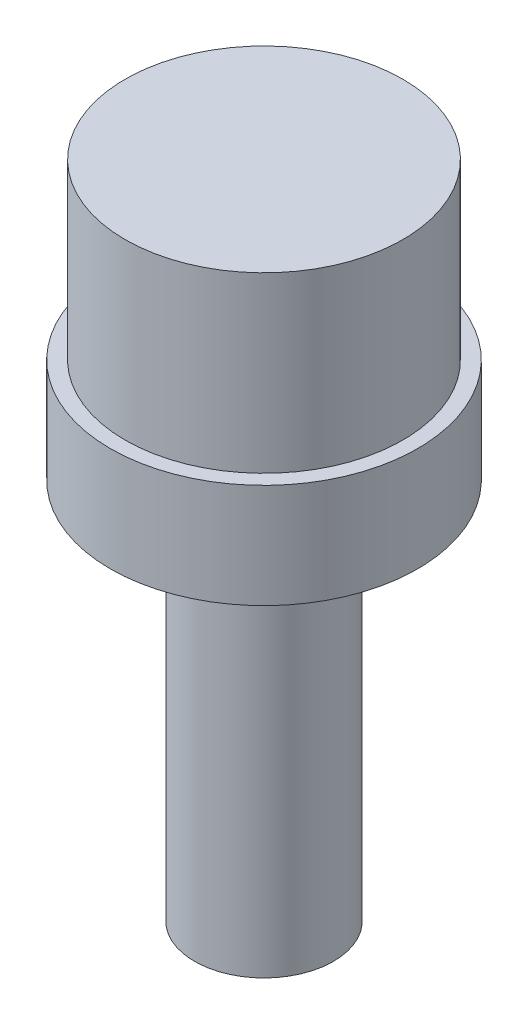
ISO-10303-21;
HEADER;
FILE_DESCRIPTION(('STEP AP214'),'2;1');
FILE_NAME('part.step','',(''),(''),'','','');
FILE_SCHEMA(('AUTOMOTIVE_DESIGN { 1 0 10303 214 1 1 1 1 }'));
ENDSEC;
DATA;
#1=APPLICATION_CONTEXT('core data for automotive mechanical design processes');
#2=APPLICATION_PROTOCOL_DEFINITION('international standard','automotive_design',2000,#1);
#3=PRODUCT_CONTEXT('',#1,'mechanical');
#4=PRODUCT('Part','Part','',(#3));
#5=PRODUCT_RELATED_PRODUCT_CATEGORY('part','',(#4));
#6=PRODUCT_DEFINITION_FORMATION('','',#4);
#7=PRODUCT_DEFINITION_CONTEXT('part definition',#1,'design');
#8=PRODUCT_DEFINITION('design','',#6,#7);
#9=PRODUCT_DEFINITION_SHAPE('','',#8);
#10=(LENGTH_UNIT() NAMED_UNIT(*) SI_UNIT(.MILLI.,.METRE.));
#11=(NAMED_UNIT(*) PLANE_ANGLE_UNIT() SI_UNIT($,.RADIAN.));
#12=(NAMED_UNIT(*) SI_UNIT($,.STERADIAN.) SOLID_ANGLE_UNIT());
#13=UNCERTAINTY_MEASURE_WITH_UNIT(LENGTH_MEASURE(1.E-05),#10,'distance_accuracy_value','');
#14=(GEOMETRIC_REPRESENTATION_CONTEXT(3) GLOBAL_UNCERTAINTY_ASSIGNED_CONTEXT((#13)) GLOBAL_UNIT_ASSIGNED_CONTEXT((#10,
#11,#12)) REPRESENTATION_CONTEXT('',''));
#15=CARTESIAN_POINT('',(0.,0.,0.));
#16=DIRECTION('',(0.,0.,1.));
#17=DIRECTION('',(1.,0.,0.));
#18=AXIS2_PLACEMENT_3D('',#15,#16,#17);
#19=CARTESIAN_POINT('',(0.,0.,0.));
#20=DIRECTION('',(0.,1.,0.));
#21=DIRECTION('',(0.,0.,1.));
#22=AXIS2_PLACEMENT_3D('',#19,#20,#21);
#23=PLANE('',#22);
#24=CARTESIAN_POINT('',(0.,0.,0.));
#25=DIRECTION('',(0.,1.,0.));
#26=DIRECTION('',(0.,0.,1.));
#27=AXIS2_PLACEMENT_3D('',#24,#25,#26);
#28=CIRCLE('',#27,4.425);
#29=CARTESIAN_POINT('',(0.,0.,4.425));
#30=VERTEX_POINT('',#29);
#31=EDGE_CURVE('E51',#30,#30,#28,.T.);
#32=ORIENTED_EDGE('',*,*,#31,.F.);
#33=EDGE_LOOP('',(#32));
#34=FACE_BOUND('',#33,.T.);
#35=DIRECTION('',(1.,0.,0.));
#36=VECTOR('',#35,1.);
#37=CARTESIAN_POINT('',(0.,0.,-1.5));
#38=LINE('',#37,#36);
#39=CARTESIAN_POINT('',(-1.3228756555323,0.,-1.5));
#40=VERTEX_POINT('',#39);
#41=CARTESIAN_POINT('',(1.3228756555323,0.,-1.5));
#42=VERTEX_POINT('',#41);
#43=EDGE_CURVE('E63',#40,#42,#38,.T.);
#44=ORIENTED_EDGE('',*,*,#43,.F.);
#45=CARTESIAN_POINT('',(0.,0.,0.));
#46=DIRECTION('',(0.,1.,0.));
#47=DIRECTION('',(0.,0.,1.));
#48=AXIS2_PLACEMENT_3D('',#45,#46,#47);
#49=CIRCLE('',#48,2.);
#50=EDGE_CURVE('E85',#40,#42,#49,.T.);
#51=ORIENTED_EDGE('',*,*,#50,.T.);
#52=EDGE_LOOP('',(#44,#51));
#53=FACE_BOUND('',#52,.T.);
#54=ADVANCED_FACE('F47',(#34,#53),#23,.F.);
#55=CARTESIAN_POINT('',(0.,3.,0.));
#56=DIRECTION('',(0.,-1.,0.));
#57=DIRECTION('',(0.,0.,-1.));
#58=AXIS2_PLACEMENT_3D('',#55,#56,#57);
#59=CYLINDRICAL_SURFACE('',#58,4.425);
#60=CARTESIAN_POINT('',(0.,3.,0.));
#61=DIRECTION('',(0.,1.,0.));
#62=DIRECTION('',(0.,0.,1.));
#63=AXIS2_PLACEMENT_3D('',#60,#61,#62);
#64=CIRCLE('',#63,4.425);
#65=CARTESIAN_POINT('',(0.,3.,4.425));
#66=VERTEX_POINT('',#65);
#67=EDGE_CURVE('E12',#66,#66,#64,.T.);
#68=ORIENTED_EDGE('',*,*,#67,.F.);
#69=EDGE_LOOP('',(#68));
#70=FACE_BOUND('',#69,.T.);
#71=ORIENTED_EDGE('',*,*,#31,.T.);
#72=EDGE_LOOP('',(#71));
#73=FACE_BOUND('',#72,.T.);
#74=ADVANCED_FACE('F49',(#70,#73),#59,.T.);
#75=CARTESIAN_POINT('',(0.,3.,0.));
#76=DIRECTION('',(0.,1.,0.));
#77=DIRECTION('',(0.,0.,1.));
#78=AXIS2_PLACEMENT_3D('',#75,#76,#77);
#79=PLANE('',#78);
#80=CARTESIAN_POINT('',(0.,3.,0.));
#81=DIRECTION('',(0.,1.,0.));
#82=DIRECTION('',(0.,0.,1.));
#83=AXIS2_PLACEMENT_3D('',#80,#81,#82);
#84=CIRCLE('',#83,4.);
#85=CARTESIAN_POINT('',(0.,3.,4.));
#86=VERTEX_POINT('',#85);
#87=EDGE_CURVE('E101',#86,#86,#84,.F.);
#88=ORIENTED_EDGE('',*,*,#87,.T.);
#89=EDGE_LOOP('',(#88));
#90=FACE_BOUND('',#89,.T.);
#91=ORIENTED_EDGE('',*,*,#67,.T.);
#92=EDGE_LOOP('',(#91));
#93=FACE_BOUND('',#92,.T.);
#94=ADVANCED_FACE('F115',(#90,#93),#79,.T.);
#95=CARTESIAN_POINT('',(0.,24.3137084989848,0.));
#96=DIRECTION('',(0.,-1.,0.));
#97=DIRECTION('',(0.,0.,-1.));
#98=AXIS2_PLACEMENT_3D('',#95,#96,#97);
#99=CYLINDRICAL_SURFACE('',#98,4.);
#100=ORIENTED_EDGE('',*,*,#87,.F.);
#101=EDGE_LOOP('',(#100));
#102=FACE_BOUND('',#101,.T.);
#103=CARTESIAN_POINT('',(0.,8.,0.));
#104=DIRECTION('',(0.,1.,0.));
#105=DIRECTION('',(0.,0.,1.));
#106=AXIS2_PLACEMENT_3D('',#103,#104,#105);
#107=CIRCLE('',#106,4.);
#108=CARTESIAN_POINT('',(0.,8.,4.));
#109=VERTEX_POINT('',#108);
#110=EDGE_CURVE('E96',#109,#109,#107,.T.);
#111=ORIENTED_EDGE('',*,*,#110,.F.);
#112=EDGE_LOOP('',(#111));
#113=FACE_BOUND('',#112,.T.);
#114=ADVANCED_FACE('F120',(#102,#113),#99,.T.);
#115=CARTESIAN_POINT('',(0.,8.,0.));
#116=DIRECTION('',(0.,1.,0.));
#117=DIRECTION('',(0.,0.,1.));
#118=AXIS2_PLACEMENT_3D('',#115,#116,#117);
#119=PLANE('',#118);
#120=ORIENTED_EDGE('',*,*,#110,.T.);
#121=EDGE_LOOP('',(#120));
#122=FACE_BOUND('',#121,.T.);
#123=ADVANCED_FACE('F121',(#122),#119,.T.);
#124=CARTESIAN_POINT('',(0.,-11.,-1.5));
#125=DIRECTION('',(0.,0.,1.));
#126=DIRECTION('',(1.,0.,0.));
#127=AXIS2_PLACEMENT_3D('',#124,#125,#126);
#128=PLANE('',#127);
#129=ORIENTED_EDGE('',*,*,#43,.T.);
#130=DIRECTION('',(0.,1.,0.));
#131=VECTOR('',#130,1.);
#132=CARTESIAN_POINT('',(1.3228756555323,-11.,-1.5));
#133=LINE('',#132,#131);
#134=CARTESIAN_POINT('',(1.3228756555323,-11.,-1.5));
#135=VERTEX_POINT('',#134);
#136=EDGE_CURVE('E81',#135,#42,#133,.T.);
#137=ORIENTED_EDGE('',*,*,#136,.F.);
#138=DIRECTION('',(1.,0.,0.));
#139=VECTOR('',#138,1.);
#140=CARTESIAN_POINT('',(0.,-11.,-1.5));
#141=LINE('',#140,#139);
#142=CARTESIAN_POINT('',(-1.3228756555323,-11.,-1.5));
#143=VERTEX_POINT('',#142);
#144=EDGE_CURVE('E71',#143,#135,#141,.T.);
#145=ORIENTED_EDGE('',*,*,#144,.F.);
#146=DIRECTION('',(0.,1.,0.));
#147=VECTOR('',#146,1.);
#148=CARTESIAN_POINT('',(-1.3228756555323,-11.,-1.5));
#149=LINE('',#148,#147);
#150=EDGE_CURVE('E75',#143,#40,#149,.T.);
#151=ORIENTED_EDGE('',*,*,#150,.T.);
#152=EDGE_LOOP('',(#129,#137,#145,#151));
#153=FACE_BOUND('',#152,.T.);
#154=ADVANCED_FACE('F77',(#153),#128,.F.);
#155=CARTESIAN_POINT('',(0.,-11.,0.));
#156=DIRECTION('',(0.,1.,0.));
#157=DIRECTION('',(0.,0.,1.));
#158=AXIS2_PLACEMENT_3D('',#155,#156,#157);
#159=CYLINDRICAL_SURFACE('',#158,2.);
#160=ORIENTED_EDGE('',*,*,#50,.F.);
#161=ORIENTED_EDGE('',*,*,#150,.F.);
#162=CARTESIAN_POINT('',(0.,-11.,0.));
#163=DIRECTION('',(0.,1.,0.));
#164=DIRECTION('',(0.,0.,1.));
#165=AXIS2_PLACEMENT_3D('',#162,#163,#164);
#166=CIRCLE('',#165,2.);
#167=EDGE_CURVE('E82',#143,#135,#166,.T.);
#168=ORIENTED_EDGE('',*,*,#167,.T.);
#169=ORIENTED_EDGE('',*,*,#136,.T.);
#170=EDGE_LOOP('',(#160,#161,#168,#169));
#171=FACE_BOUND('',#170,.T.);
#172=ADVANCED_FACE('F86',(#171),#159,.T.);
#173=CARTESIAN_POINT('',(0.,-11.,0.));
#174=DIRECTION('',(0.,1.,0.));
#175=DIRECTION('',(0.,0.,1.));
#176=AXIS2_PLACEMENT_3D('',#173,#174,#175);
#177=PLANE('',#176);
#178=ORIENTED_EDGE('',*,*,#144,.T.);
#179=ORIENTED_EDGE('',*,*,#167,.F.);
#180=EDGE_LOOP('',(#178,#179));
#181=FACE_BOUND('',#180,.T.);
#182=ADVANCED_FACE('F132',(#181),#177,.F.);
#183=CLOSED_SHELL('',(#54,#74,#94,#114,#123,#154,#172,#182));
#184=MANIFOLD_SOLID_BREP('B2',#183);
#185=ADVANCED_BREP_SHAPE_REPRESENTATION('',(#18,#184),#14);
#186=SHAPE_DEFINITION_REPRESENTATION(#9,#185);
ENDSEC;
END-ISO-10303-21;
